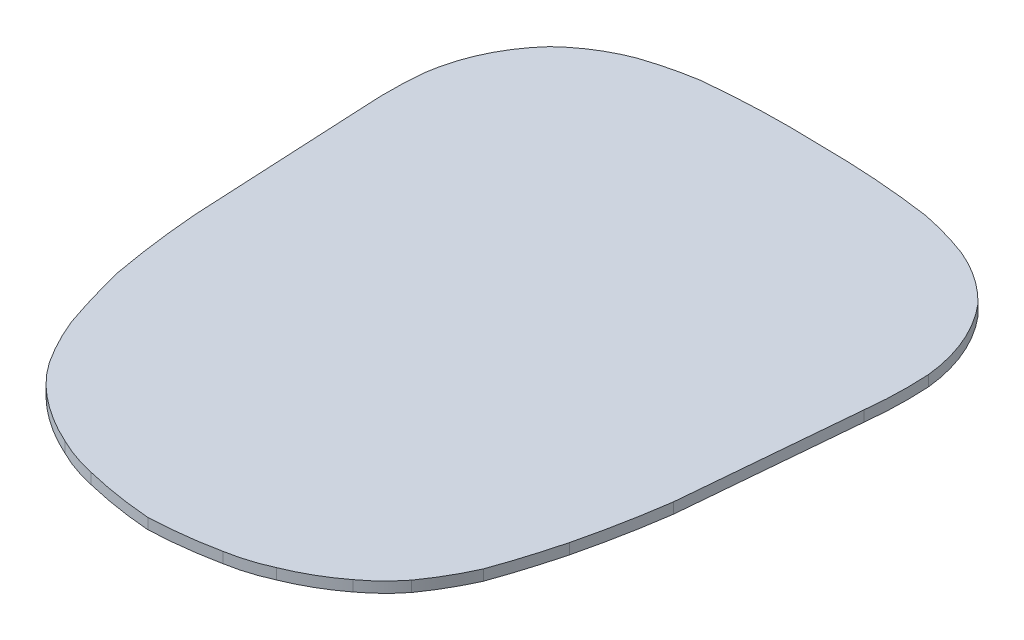
ISO-10303-21;
HEADER;
FILE_DESCRIPTION(('STEP AP214'),'2;1');
FILE_NAME('part.step','',(''),(''),'','','');
FILE_SCHEMA(('AUTOMOTIVE_DESIGN { 1 0 10303 214 1 1 1 1 }'));
ENDSEC;
DATA;
#1=APPLICATION_CONTEXT('core data for automotive mechanical design processes');
#2=APPLICATION_PROTOCOL_DEFINITION('international standard','automotive_design',2000,#1);
#3=PRODUCT_CONTEXT('',#1,'mechanical');
#4=PRODUCT('Part','Part','',(#3));
#5=PRODUCT_RELATED_PRODUCT_CATEGORY('part','',(#4));
#6=PRODUCT_DEFINITION_FORMATION('','',#4);
#7=PRODUCT_DEFINITION_CONTEXT('part definition',#1,'design');
#8=PRODUCT_DEFINITION('design','',#6,#7);
#9=PRODUCT_DEFINITION_SHAPE('','',#8);
#10=(LENGTH_UNIT() NAMED_UNIT(*) SI_UNIT(.MILLI.,.METRE.));
#11=(NAMED_UNIT(*) PLANE_ANGLE_UNIT() SI_UNIT($,.RADIAN.));
#12=(NAMED_UNIT(*) SI_UNIT($,.STERADIAN.) SOLID_ANGLE_UNIT());
#13=UNCERTAINTY_MEASURE_WITH_UNIT(LENGTH_MEASURE(1.E-05),#10,'distance_accuracy_value','');
#14=(GEOMETRIC_REPRESENTATION_CONTEXT(3) GLOBAL_UNCERTAINTY_ASSIGNED_CONTEXT((#13)) GLOBAL_UNIT_ASSIGNED_CONTEXT((#10,
#11,#12)) REPRESENTATION_CONTEXT('',''));
#15=CARTESIAN_POINT('',(0.,0.,0.));
#16=DIRECTION('',(0.,0.,1.));
#17=DIRECTION('',(1.,0.,0.));
#18=AXIS2_PLACEMENT_3D('',#15,#16,#17);
#19=CARTESIAN_POINT('',(4.71009628830566,8.17060732929225,26.5172961946225));
#20=DIRECTION('',(0.,1.,0.));
#21=DIRECTION('',(1.,0.,0.));
#22=AXIS2_PLACEMENT_3D('',#19,#20,#21);
#23=PLANE('',#22);
#24=CARTESIAN_POINT('',(-2.27662830007277,8.17060732929219,38.4722908655234));
#25=DIRECTION('',(0.,-1.,0.));
#26=DIRECTION('',(-1.,0.,0.));
#27=AXIS2_PLACEMENT_3D('',#24,#25,#26);
#28=CIRCLE('',#27,12.60940452968);
#29=CARTESIAN_POINT('',(9.22351885768009,8.17060732929263,43.6437218031986));
#30=VERTEX_POINT('',#29);
#31=CARTESIAN_POINT('',(8.0018089067517,8.17060732929262,45.7764548271607));
#32=VERTEX_POINT('',#31);
#33=EDGE_CURVE('E342',#30,#32,#28,.T.);
#34=ORIENTED_EDGE('',*,*,#33,.F.);
#35=CARTESIAN_POINT('',(-23.6697185475928,8.17060732929142,31.8539569853535));
#36=DIRECTION('',(0.,-1.,0.));
#37=DIRECTION('',(-1.,0.,0.));
#38=AXIS2_PLACEMENT_3D('',#35,#36,#37);
#39=CIRCLE('',#38,34.94228987144);
#40=CARTESIAN_POINT('',(10.1680744257548,8.17060732929263,40.5698842540157));
#41=VERTEX_POINT('',#40);
#42=EDGE_CURVE('E338',#41,#30,#39,.T.);
#43=ORIENTED_EDGE('',*,*,#42,.F.);
#44=CARTESIAN_POINT('',(-29.9774053404909,8.1706073292912,30.7359674961748));
#45=DIRECTION('',(0.,-1.,0.));
#46=DIRECTION('',(-1.,0.,0.));
#47=AXIS2_PLACEMENT_3D('',#44,#45,#46);
#48=CIRCLE('',#47,41.33237791928);
#49=CARTESIAN_POINT('',(10.952153070885,8.17060732929257,36.4924171582454));
#50=VERTEX_POINT('',#49);
#51=EDGE_CURVE('E334',#50,#41,#48,.T.);
#52=ORIENTED_EDGE('',*,*,#51,.F.);
#53=DIRECTION('',(-0.0886995040357044,0.,0.996058431008854));
#54=VECTOR('',#53,1.);
#55=CARTESIAN_POINT('',(11.6806465076375,8.17060732929258,28.3117397407053));
#56=LINE('',#55,#54);
#57=CARTESIAN_POINT('',(11.6806465076375,8.17060732929253,28.3117397407053));
#58=VERTEX_POINT('',#57);
#59=EDGE_CURVE('E221',#50,#58,#56,.F.);
#60=ORIENTED_EDGE('',*,*,#59,.T.);
#61=CARTESIAN_POINT('',(-5.02148164229073,8.17060732929194,26.393099302876));
#62=DIRECTION('',(0.,-1.,0.));
#63=DIRECTION('',(-1.,0.,0.));
#64=AXIS2_PLACEMENT_3D('',#61,#62,#63);
#65=CIRCLE('',#64,16.81196793556);
#66=CARTESIAN_POINT('',(11.7593440485896,8.17060732929246,25.370282115599));
#67=VERTEX_POINT('',#66);
#68=EDGE_CURVE('E331',#67,#58,#65,.T.);
#69=ORIENTED_EDGE('',*,*,#68,.F.);
#70=CARTESIAN_POINT('',(4.42207857906214,8.17060732929224,26.1060065080088));
#71=DIRECTION('',(0.,-1.,0.));
#72=DIRECTION('',(-1.,0.,0.));
#73=AXIS2_PLACEMENT_3D('',#70,#71,#72);
#74=CIRCLE('',#73,7.3740595978);
#75=CARTESIAN_POINT('',(10.0538039694727,8.17060732929235,21.3457098703073));
#76=VERTEX_POINT('',#75);
#77=EDGE_CURVE('E326',#76,#67,#74,.T.);
#78=ORIENTED_EDGE('',*,*,#77,.F.);
#79=CARTESIAN_POINT('',(4.71009628830566,8.17060732929225,26.5172961946225));
#80=DIRECTION('',(0.,-1.,0.));
#81=DIRECTION('',(-1.,0.,0.));
#82=AXIS2_PLACEMENT_3D('',#79,#80,#81);
#83=CIRCLE('',#82,7.43643173111999);
#84=CARTESIAN_POINT('',(7.59877825453688,8.17060732929224,19.6648489391102));
#85=VERTEX_POINT('',#84);
#86=EDGE_CURVE('E202',#85,#76,#83,.T.);
#87=ORIENTED_EDGE('',*,*,#86,.F.);
#88=CARTESIAN_POINT('',(2.32340041465539,8.17060732929227,33.6186466915631));
#89=DIRECTION('',(0.,-1.,0.));
#90=DIRECTION('',(-1.,0.,0.));
#91=AXIS2_PLACEMENT_3D('',#88,#89,#90);
#92=CIRCLE('',#91,14.91771038296);
#93=CARTESIAN_POINT('',(5.25502065738684,8.17060732929216,18.9918327588476));
#94=VERTEX_POINT('',#93);
#95=EDGE_CURVE('E20',#94,#85,#92,.T.);
#96=ORIENTED_EDGE('',*,*,#95,.F.);
#97=CARTESIAN_POINT('',(-0.135712780641824,8.17060732929251,56.7959011448421));
#98=DIRECTION('',(0.,-1.,0.));
#99=DIRECTION('',(-1.,0.,0.));
#100=AXIS2_PLACEMENT_3D('',#97,#98,#99);
#101=CIRCLE('',#100,38.186484435371);
#102=CARTESIAN_POINT('',(-0.11509847713785,8.17060732929198,18.6094222736066));
#103=VERTEX_POINT('',#102);
#104=EDGE_CURVE('E187',#103,#94,#101,.T.);
#105=ORIENTED_EDGE('',*,*,#104,.F.);
#106=CARTESIAN_POINT('',(-1.57240860866994,8.17060732929247,56.7680888848849));
#107=DIRECTION('',(0.,-1.,0.));
#108=DIRECTION('',(-1.,0.,0.));
#109=AXIS2_PLACEMENT_3D('',#106,#107,#108);
#110=CIRCLE('',#109,38.18648439396);
#111=CARTESIAN_POINT('',(-5.4959944251525,8.17060732929181,18.7837096651208));
#112=VERTEX_POINT('',#111);
#113=EDGE_CURVE('E211',#112,#103,#110,.T.);
#114=ORIENTED_EDGE('',*,*,#113,.F.);
#115=CARTESIAN_POINT('',(-3.13266364538485,8.17060732929209,33.5130256945661));
#116=DIRECTION('',(0.,-1.,0.));
#117=DIRECTION('',(-1.,0.,0.));
#118=AXIS2_PLACEMENT_3D('',#115,#116,#117);
#119=CIRCLE('',#118,14.91771038296);
#120=CARTESIAN_POINT('',(-7.86404338634437,8.17060732929175,19.3655125273444));
#121=VERTEX_POINT('',#120);
#122=EDGE_CURVE('E400',#121,#112,#119,.T.);
#123=ORIENTED_EDGE('',*,*,#122,.F.);
#124=CARTESIAN_POINT('',(-5.24273193998366,8.17060732929193,26.3246247690593));
#125=DIRECTION('',(0.,-1.,0.));
#126=DIRECTION('',(-1.,0.,0.));
#127=AXIS2_PLACEMENT_3D('',#124,#125,#126);
#128=CIRCLE('',#127,7.43643173112);
#129=CARTESIAN_POINT('',(-10.3822831278824,8.17060732929169,20.9500986989228));
#130=VERTEX_POINT('',#129);
#131=EDGE_CURVE('E396',#130,#121,#128,.T.);
#132=ORIENTED_EDGE('',*,*,#131,.F.);
#133=CARTESIAN_POINT('',(-4.93901211459919,8.17060732929193,25.9247902097461));
#134=DIRECTION('',(0.,-1.,0.));
#135=DIRECTION('',(-1.,0.,0.));
#136=AXIS2_PLACEMENT_3D('',#133,#134,#135);
#137=CIRCLE('',#136,7.3740595978);
#138=CARTESIAN_POINT('',(-12.2423060527563,8.17060732929169,24.9056471359907));
#139=VERTEX_POINT('',#138);
#140=EDGE_CURVE('E392',#139,#130,#137,.T.);
#141=ORIENTED_EDGE('',*,*,#140,.F.);
#142=CARTESIAN_POINT('',(4.48636162568603,8.17060732929224,26.5771565049552));
#143=DIRECTION('',(0.,-1.,0.));
#144=DIRECTION('',(-1.,0.,0.));
#145=AXIS2_PLACEMENT_3D('',#142,#143,#144);
#146=CIRCLE('',#145,16.81196793556);
#147=CARTESIAN_POINT('',(-12.2775089900257,8.17060732929172,27.8479467496356));
#148=VERTEX_POINT('',#147);
#149=EDGE_CURVE('E388',#148,#139,#146,.T.);
#150=ORIENTED_EDGE('',*,*,#149,.F.);
#151=DIRECTION('',(-0.0500831809567766,0.,-0.998745050042928));
#152=VECTOR('',#151,1.);
#153=CARTESIAN_POINT('',(-11.8661733347101,8.17060732929172,36.0506895028802));
#154=LINE('',#153,#152);
#155=CARTESIAN_POINT('',(-11.86617333471,8.17060732929178,36.0506895028806));
#156=VERTEX_POINT('',#155);
#157=EDGE_CURVE('E227',#148,#156,#154,.F.);
#158=ORIENTED_EDGE('',*,*,#157,.T.);
#159=CARTESIAN_POINT('',(29.3351155793446,8.17060732929312,32.7614257124886));
#160=DIRECTION('',(0.,-1.,0.));
#161=DIRECTION('',(-1.,0.,0.));
#162=AXIS2_PLACEMENT_3D('',#159,#160,#161);
#163=CIRCLE('',#162,41.33237791928);
#164=CARTESIAN_POINT('',(-11.3308378537234,8.17060732929194,40.1536984240254));
#165=VERTEX_POINT('',#164);
#166=EDGE_CURVE('E386',#165,#156,#163,.T.);
#167=ORIENTED_EDGE('',*,*,#166,.F.);
#168=CARTESIAN_POINT('',(22.6114523086669,8.1706073292929,31.8540261418301));
#169=DIRECTION('',(0.,-1.,0.));
#170=DIRECTION('',(-1.,0.,0.));
#171=AXIS2_PLACEMENT_3D('',#168,#169,#170);
#172=CIRCLE('',#171,34.94228987144);
#173=CARTESIAN_POINT('',(-10.4156070143637,8.17060732929201,43.2635385736895));
#174=VERTEX_POINT('',#173);
#175=EDGE_CURVE('E382',#174,#165,#172,.T.);
#176=ORIENTED_EDGE('',*,*,#175,.F.);
#177=CARTESIAN_POINT('',(1.27607088396138,8.17060732929231,38.5410656500053));
#178=DIRECTION('',(0.,-1.,0.));
#179=DIRECTION('',(-1.,0.,0.));
#180=AXIS2_PLACEMENT_3D('',#177,#178,#179);
#181=CIRCLE('',#180,12.60940452968);
#182=CARTESIAN_POINT('',(-9.27735431255513,8.17060732929206,45.4419568398912));
#183=VERTEX_POINT('',#182);
#184=EDGE_CURVE('E378',#183,#174,#181,.T.);
#185=ORIENTED_EDGE('',*,*,#184,.F.);
#186=CARTESIAN_POINT('',(-3.45763258069564,8.17060732929219,41.376110818803));
#187=DIRECTION('',(0.,-1.,0.));
#188=DIRECTION('',(-1.,0.,0.));
#189=AXIS2_PLACEMENT_3D('',#186,#187,#188);
#190=CIRCLE('',#189,7.09931439672);
#191=CARTESIAN_POINT('',(-7.97915028682798,8.17060732929213,46.8493313092097));
#192=VERTEX_POINT('',#191);
#193=EDGE_CURVE('E374',#192,#183,#190,.T.);
#194=ORIENTED_EDGE('',*,*,#193,.F.);
#195=CARTESIAN_POINT('',(-1.74390750050744,8.17060732929222,39.3302094350336));
#196=DIRECTION('',(0.,-1.,0.));
#197=DIRECTION('',(-1.,0.,0.));
#198=AXIS2_PLACEMENT_3D('',#195,#196,#197);
#199=CIRCLE('',#198,9.76808304444);
#200=CARTESIAN_POINT('',(-5.75361833776054,8.17060732929222,48.2373787589373));
#201=VERTEX_POINT('',#200);
#202=EDGE_CURVE('E370',#201,#192,#199,.T.);
#203=ORIENTED_EDGE('',*,*,#202,.F.);
#204=CARTESIAN_POINT('',(-2.25185647870526,8.17060732929223,41.3098252240713));
#205=DIRECTION('',(0.,-1.,0.));
#206=DIRECTION('',(-1.,0.,0.));
#207=AXIS2_PLACEMENT_3D('',#204,#205,#206);
#208=CIRCLE('',#207,7.76230211316);
#209=CARTESIAN_POINT('',(-3.87229574569533,8.17060732929228,48.9011038171652));
#210=VERTEX_POINT('',#209);
#211=EDGE_CURVE('E366',#210,#201,#208,.T.);
#212=ORIENTED_EDGE('',*,*,#211,.F.);
#213=CARTESIAN_POINT('',(0.780834496719686,8.17060732929217,29.8233057086877));
#214=DIRECTION('',(0.,-1.,0.));
#215=DIRECTION('',(-1.,0.,0.));
#216=AXIS2_PLACEMENT_3D('',#213,#214,#215);
#217=CIRCLE('',#216,19.63705684976);
#218=CARTESIAN_POINT('',(-0.711226246908824,8.1706073292924,49.4035957080219));
#219=VERTEX_POINT('',#218);
#220=EDGE_CURVE('E362',#219,#210,#217,.T.);
#221=ORIENTED_EDGE('',*,*,#220,.F.);
#222=CARTESIAN_POINT('',(-1.50562705310564,8.1706073292921,29.7823019466603));
#223=DIRECTION('',(0.,-1.,0.));
#224=DIRECTION('',(-1.,0.,0.));
#225=AXIS2_PLACEMENT_3D('',#222,#223,#224);
#226=CIRCLE('',#225,19.6373684976);
#227=CARTESIAN_POINT('',(2.42169589731131,8.17060732929249,49.0229458016269));
#228=VERTEX_POINT('',#227);
#229=EDGE_CURVE('E358',#228,#219,#226,.T.);
#230=ORIENTED_EDGE('',*,*,#229,.F.);
#231=CARTESIAN_POINT('',(1.09627151620212,8.17060732929234,41.3746398254038));
#232=DIRECTION('',(0.,-1.,0.));
#233=DIRECTION('',(-1.,0.,0.));
#234=AXIS2_PLACEMENT_3D('',#231,#232,#233);
#235=CIRCLE('',#234,7.76230211316);
#236=CARTESIAN_POINT('',(4.32729672971708,8.17060732929254,48.4325297484331));
#237=VERTEX_POINT('',#236);
#238=EDGE_CURVE('E354',#237,#228,#235,.T.);
#239=ORIENTED_EDGE('',*,*,#238,.F.);
#240=CARTESIAN_POINT('',(0.665319016808416,8.1706073292923,39.3768483498173));
#241=DIRECTION('',(0.,-1.,0.));
#242=DIRECTION('',(-1.,0.,0.));
#243=AXIS2_PLACEMENT_3D('',#240,#241,#242);
#244=CIRCLE('',#243,9.76808304444);
#245=CARTESIAN_POINT('',(6.60488205735884,8.1706073292926,47.1316557136661));
#246=VERTEX_POINT('',#245);
#247=EDGE_CURVE('E350',#246,#237,#244,.T.);
#248=ORIENTED_EDGE('',*,*,#247,.F.);
#249=CARTESIAN_POINT('',(2.40671094314165,8.17060732929238,41.4066557836025));
#250=DIRECTION('',(0.,-1.,0.));
#251=DIRECTION('',(-1.,0.,0.));
#252=AXIS2_PLACEMENT_3D('',#249,#250,#251);
#253=CIRCLE('',#252,7.09931439672);
#254=EDGE_CURVE('E346',#32,#246,#253,.T.);
#255=ORIENTED_EDGE('',*,*,#254,.F.);
#256=EDGE_LOOP('',(#34,#43,#52,#60,#69,#78,#87,#96,#105,#114,#123,#132,#141,#150,#158,#167,#176,
#185,#194,#203,#212,#221,#230,#239,#248,#255));
#257=FACE_BOUND('',#256,.T.);
#258=ADVANCED_FACE('F17',(#257),#23,.T.);
#259=CARTESIAN_POINT('',(2.32340041465539,8.05060732929227,33.6186466915631));
#260=DIRECTION('',(0.,-1.,0.));
#261=DIRECTION('',(-1.,0.,0.));
#262=AXIS2_PLACEMENT_3D('',#259,#260,#261);
#263=CYLINDRICAL_SURFACE('',#262,14.91771038296);
#264=DIRECTION('',(0.,-1.,0.));
#265=VECTOR('',#264,1.);
#266=CARTESIAN_POINT('',(7.59877825453691,8.05060732929224,19.6648489391103));
#267=LINE('',#266,#265);
#268=CARTESIAN_POINT('',(7.5987782545369,7.66960732929226,19.6648489391102));
#269=VERTEX_POINT('',#268);
#270=EDGE_CURVE('E325',#269,#85,#267,.F.);
#271=ORIENTED_EDGE('',*,*,#270,.F.);
#272=CARTESIAN_POINT('',(2.3234004146554,7.66960732929227,33.6186466915632));
#273=DIRECTION('',(0.,-1.,0.));
#274=DIRECTION('',(-1.,0.,0.));
#275=AXIS2_PLACEMENT_3D('',#272,#273,#274);
#276=CIRCLE('',#275,14.91771038296);
#277=CARTESIAN_POINT('',(5.25502065738685,7.66960732929216,18.9918327588476));
#278=VERTEX_POINT('',#277);
#279=EDGE_CURVE('E209',#269,#278,#276,.F.);
#280=ORIENTED_EDGE('',*,*,#279,.T.);
#281=DIRECTION('',(0.,-1.,0.));
#282=VECTOR('',#281,1.);
#283=CARTESIAN_POINT('',(5.25502065738685,8.05060732929216,18.9918327588476));
#284=LINE('',#283,#282);
#285=EDGE_CURVE('E192',#94,#278,#284,.T.);
#286=ORIENTED_EDGE('',*,*,#285,.F.);
#287=ORIENTED_EDGE('',*,*,#95,.T.);
#288=EDGE_LOOP('',(#271,#280,#286,#287));
#289=FACE_BOUND('',#288,.T.);
#290=ADVANCED_FACE('F208',(#289),#263,.T.);
#291=CARTESIAN_POINT('',(-0.13571278064182,8.05060732929252,56.7959011448421));
#292=DIRECTION('',(0.,-1.,0.));
#293=DIRECTION('',(-1.,0.,0.));
#294=AXIS2_PLACEMENT_3D('',#291,#292,#293);
#295=CYLINDRICAL_SURFACE('',#294,38.186484435371);
#296=ORIENTED_EDGE('',*,*,#285,.T.);
#297=CARTESIAN_POINT('',(-0.135712780641808,7.66960732929252,56.7959011448422));
#298=DIRECTION('',(0.,-1.,0.));
#299=DIRECTION('',(-1.,0.,0.));
#300=AXIS2_PLACEMENT_3D('',#297,#298,#299);
#301=CIRCLE('',#300,38.186484435371);
#302=CARTESIAN_POINT('',(-0.115098477137834,7.66960732929198,18.6094222736066));
#303=VERTEX_POINT('',#302);
#304=EDGE_CURVE('E318',#278,#303,#301,.F.);
#305=ORIENTED_EDGE('',*,*,#304,.T.);
#306=DIRECTION('',(0.,-1.,0.));
#307=VECTOR('',#306,1.);
#308=CARTESIAN_POINT('',(-0.115098477137861,8.05060732929198,18.6094222736066));
#309=LINE('',#308,#307);
#310=EDGE_CURVE('E194',#103,#303,#309,.T.);
#311=ORIENTED_EDGE('',*,*,#310,.F.);
#312=ORIENTED_EDGE('',*,*,#104,.T.);
#313=EDGE_LOOP('',(#296,#305,#311,#312));
#314=FACE_BOUND('',#313,.T.);
#315=ADVANCED_FACE('F189',(#314),#295,.T.);
#316=CARTESIAN_POINT('',(-1.57240860866994,8.05060732929247,56.7680888848849));
#317=DIRECTION('',(0.,-1.,0.));
#318=DIRECTION('',(-1.,0.,0.));
#319=AXIS2_PLACEMENT_3D('',#316,#317,#318);
#320=CYLINDRICAL_SURFACE('',#319,38.18648439396);
#321=ORIENTED_EDGE('',*,*,#310,.T.);
#322=CARTESIAN_POINT('',(-1.57240860866992,7.66960732929248,56.7680888848849));
#323=DIRECTION('',(0.,-1.,0.));
#324=DIRECTION('',(-1.,0.,0.));
#325=AXIS2_PLACEMENT_3D('',#322,#323,#324);
#326=CIRCLE('',#325,38.18648439396);
#327=CARTESIAN_POINT('',(-5.49599442515248,7.66960732929181,18.7837096651208));
#328=VERTEX_POINT('',#327);
#329=EDGE_CURVE('E314',#303,#328,#326,.F.);
#330=ORIENTED_EDGE('',*,*,#329,.T.);
#331=DIRECTION('',(0.,-1.,0.));
#332=VECTOR('',#331,1.);
#333=CARTESIAN_POINT('',(-5.49599442515248,8.05060732929181,18.7837096651208));
#334=LINE('',#333,#332);
#335=EDGE_CURVE('E399',#112,#328,#334,.T.);
#336=ORIENTED_EDGE('',*,*,#335,.F.);
#337=ORIENTED_EDGE('',*,*,#113,.T.);
#338=EDGE_LOOP('',(#321,#330,#336,#337));
#339=FACE_BOUND('',#338,.T.);
#340=ADVANCED_FACE('F410',(#339),#320,.T.);
#341=CARTESIAN_POINT('',(-3.13266364538485,8.0506073292921,33.5130256945661));
#342=DIRECTION('',(0.,-1.,0.));
#343=DIRECTION('',(-1.,0.,0.));
#344=AXIS2_PLACEMENT_3D('',#341,#342,#343);
#345=CYLINDRICAL_SURFACE('',#344,14.91771038296);
#346=ORIENTED_EDGE('',*,*,#335,.T.);
#347=CARTESIAN_POINT('',(-3.13266364538484,7.6696073292921,33.5130256945661));
#348=DIRECTION('',(0.,-1.,0.));
#349=DIRECTION('',(-1.,0.,0.));
#350=AXIS2_PLACEMENT_3D('',#347,#348,#349);
#351=CIRCLE('',#350,14.91771038296);
#352=CARTESIAN_POINT('',(-7.86404338634436,7.66960732929176,19.3655125273444));
#353=VERTEX_POINT('',#352);
#354=EDGE_CURVE('E310',#328,#353,#351,.F.);
#355=ORIENTED_EDGE('',*,*,#354,.T.);
#356=DIRECTION('',(0.,-1.,0.));
#357=VECTOR('',#356,1.);
#358=CARTESIAN_POINT('',(-7.86404338634434,8.05060732929175,19.3655125273444));
#359=LINE('',#358,#357);
#360=EDGE_CURVE('E395',#121,#353,#359,.T.);
#361=ORIENTED_EDGE('',*,*,#360,.F.);
#362=ORIENTED_EDGE('',*,*,#122,.T.);
#363=EDGE_LOOP('',(#346,#355,#361,#362));
#364=FACE_BOUND('',#363,.T.);
#365=ADVANCED_FACE('F418',(#364),#345,.T.);
#366=CARTESIAN_POINT('',(-5.24273193998366,8.05060732929193,26.3246247690593));
#367=DIRECTION('',(0.,-1.,0.));
#368=DIRECTION('',(-1.,0.,0.));
#369=AXIS2_PLACEMENT_3D('',#366,#367,#368);
#370=CYLINDRICAL_SURFACE('',#369,7.43643173112);
#371=ORIENTED_EDGE('',*,*,#360,.T.);
#372=CARTESIAN_POINT('',(-5.24273193998365,7.66960732929194,26.3246247690593));
#373=DIRECTION('',(0.,-1.,0.));
#374=DIRECTION('',(-1.,0.,0.));
#375=AXIS2_PLACEMENT_3D('',#372,#373,#374);
#376=CIRCLE('',#375,7.43643173112);
#377=CARTESIAN_POINT('',(-10.3822831278824,7.66960732929169,20.9500986989228));
#378=VERTEX_POINT('',#377);
#379=EDGE_CURVE('E306',#353,#378,#376,.F.);
#380=ORIENTED_EDGE('',*,*,#379,.T.);
#381=DIRECTION('',(0.,-1.,0.));
#382=VECTOR('',#381,1.);
#383=CARTESIAN_POINT('',(-10.3822831278824,8.05060732929169,20.9500986989228));
#384=LINE('',#383,#382);
#385=EDGE_CURVE('E391',#130,#378,#384,.T.);
#386=ORIENTED_EDGE('',*,*,#385,.F.);
#387=ORIENTED_EDGE('',*,*,#131,.T.);
#388=EDGE_LOOP('',(#371,#380,#386,#387));
#389=FACE_BOUND('',#388,.T.);
#390=ADVANCED_FACE('F559',(#389),#370,.T.);
#391=CARTESIAN_POINT('',(-4.93901211459919,8.05060732929193,25.9247902097461));
#392=DIRECTION('',(0.,-1.,0.));
#393=DIRECTION('',(-1.,0.,0.));
#394=AXIS2_PLACEMENT_3D('',#391,#392,#393);
#395=CYLINDRICAL_SURFACE('',#394,7.3740595978);
#396=ORIENTED_EDGE('',*,*,#385,.T.);
#397=CARTESIAN_POINT('',(-4.93901211459917,7.66960732929193,25.9247902097461));
#398=DIRECTION('',(0.,-1.,0.));
#399=DIRECTION('',(-1.,0.,0.));
#400=AXIS2_PLACEMENT_3D('',#397,#398,#399);
#401=CIRCLE('',#400,7.3740595978);
#402=CARTESIAN_POINT('',(-12.2423060527563,7.66960732929169,24.9056471359907));
#403=VERTEX_POINT('',#402);
#404=EDGE_CURVE('E302',#378,#403,#401,.F.);
#405=ORIENTED_EDGE('',*,*,#404,.T.);
#406=DIRECTION('',(0.,-1.,0.));
#407=VECTOR('',#406,1.);
#408=CARTESIAN_POINT('',(-12.2423060527563,8.05060732929169,24.9056471359907));
#409=LINE('',#408,#407);
#410=EDGE_CURVE('E231',#139,#403,#409,.T.);
#411=ORIENTED_EDGE('',*,*,#410,.F.);
#412=ORIENTED_EDGE('',*,*,#140,.T.);
#413=EDGE_LOOP('',(#396,#405,#411,#412));
#414=FACE_BOUND('',#413,.T.);
#415=ADVANCED_FACE('F556',(#414),#395,.T.);
#416=CARTESIAN_POINT('',(4.48636162568604,8.05060732929224,26.5771565049552));
#417=DIRECTION('',(0.,-1.,0.));
#418=DIRECTION('',(-1.,0.,0.));
#419=AXIS2_PLACEMENT_3D('',#416,#417,#418);
#420=CYLINDRICAL_SURFACE('',#419,16.81196793556);
#421=ORIENTED_EDGE('',*,*,#410,.T.);
#422=CARTESIAN_POINT('',(4.48636162568605,7.66960732929224,26.5771565049552));
#423=DIRECTION('',(0.,-1.,0.));
#424=DIRECTION('',(-1.,0.,0.));
#425=AXIS2_PLACEMENT_3D('',#422,#423,#424);
#426=CIRCLE('',#425,16.81196793556);
#427=CARTESIAN_POINT('',(-12.2775089900257,7.66960732929173,27.8479467496356));
#428=VERTEX_POINT('',#427);
#429=EDGE_CURVE('E298',#403,#428,#426,.F.);
#430=ORIENTED_EDGE('',*,*,#429,.T.);
#431=DIRECTION('',(0.,1.,0.));
#432=VECTOR('',#431,1.);
#433=CARTESIAN_POINT('',(-12.2775089900257,8.05060732929185,27.8479467496356));
#434=LINE('',#433,#432);
#435=EDGE_CURVE('E230',#428,#148,#434,.T.);
#436=ORIENTED_EDGE('',*,*,#435,.T.);
#437=ORIENTED_EDGE('',*,*,#149,.T.);
#438=EDGE_LOOP('',(#421,#430,#436,#437));
#439=FACE_BOUND('',#438,.T.);
#440=ADVANCED_FACE('F552',(#439),#420,.T.);
#441=CARTESIAN_POINT('',(-11.8661733347101,8.05060732929185,36.0506895028802));
#442=DIRECTION('',(0.998745050042928,0.,-0.0500831809567766));
#443=DIRECTION('',(-0.0500831809567766,0.,-0.998745050042928));
#444=AXIS2_PLACEMENT_3D('',#441,#442,#443);
#445=PLANE('',#444);
#446=DIRECTION('',(0.0500831809567767,0.,0.998745050042928));
#447=VECTOR('',#446,1.);
#448=CARTESIAN_POINT('',(-12.2775089900257,7.66960732929172,27.8479467496356));
#449=LINE('',#448,#447);
#450=CARTESIAN_POINT('',(-11.86617333471,7.66960732929185,36.0506895028806));
#451=VERTEX_POINT('',#450);
#452=EDGE_CURVE('E297',#428,#451,#449,.T.);
#453=ORIENTED_EDGE('',*,*,#452,.T.);
#454=DIRECTION('',(0.,-1.,0.));
#455=VECTOR('',#454,1.);
#456=CARTESIAN_POINT('',(-11.86617333471,8.05060732929185,36.0506895028805));
#457=LINE('',#456,#455);
#458=EDGE_CURVE('E385',#156,#451,#457,.T.);
#459=ORIENTED_EDGE('',*,*,#458,.F.);
#460=ORIENTED_EDGE('',*,*,#157,.F.);
#461=ORIENTED_EDGE('',*,*,#435,.F.);
#462=EDGE_LOOP('',(#453,#459,#460,#461));
#463=FACE_BOUND('',#462,.T.);
#464=ADVANCED_FACE('F549',(#463),#445,.F.);
#465=CARTESIAN_POINT('',(29.3351155793446,8.05060732929312,32.7614257124887));
#466=DIRECTION('',(0.,-1.,0.));
#467=DIRECTION('',(-1.,0.,0.));
#468=AXIS2_PLACEMENT_3D('',#465,#466,#467);
#469=CYLINDRICAL_SURFACE('',#468,41.33237791928);
#470=ORIENTED_EDGE('',*,*,#458,.T.);
#471=CARTESIAN_POINT('',(29.3351155793447,7.66960732929312,32.7614257124887));
#472=DIRECTION('',(0.,-1.,0.));
#473=DIRECTION('',(-1.,0.,0.));
#474=AXIS2_PLACEMENT_3D('',#471,#472,#473);
#475=CIRCLE('',#474,41.33237791928);
#476=CARTESIAN_POINT('',(-11.3308378537234,7.66960732929192,40.1536984240254));
#477=VERTEX_POINT('',#476);
#478=EDGE_CURVE('E293',#451,#477,#475,.F.);
#479=ORIENTED_EDGE('',*,*,#478,.T.);
#480=DIRECTION('',(0.,-1.,0.));
#481=VECTOR('',#480,1.);
#482=CARTESIAN_POINT('',(-11.3308378537233,8.05060732929194,40.1536984240255));
#483=LINE('',#482,#481);
#484=EDGE_CURVE('E381',#165,#477,#483,.T.);
#485=ORIENTED_EDGE('',*,*,#484,.F.);
#486=ORIENTED_EDGE('',*,*,#166,.T.);
#487=EDGE_LOOP('',(#470,#479,#485,#486));
#488=FACE_BOUND('',#487,.T.);
#489=ADVANCED_FACE('F544',(#488),#469,.T.);
#490=CARTESIAN_POINT('',(22.6114523086669,8.0506073292929,31.8540261418301));
#491=DIRECTION('',(0.,-1.,0.));
#492=DIRECTION('',(-1.,0.,0.));
#493=AXIS2_PLACEMENT_3D('',#490,#491,#492);
#494=CYLINDRICAL_SURFACE('',#493,34.94228987144);
#495=ORIENTED_EDGE('',*,*,#484,.T.);
#496=CARTESIAN_POINT('',(22.6114523086669,7.66960732929289,31.8540261418301));
#497=DIRECTION('',(0.,-1.,0.));
#498=DIRECTION('',(-1.,0.,0.));
#499=AXIS2_PLACEMENT_3D('',#496,#497,#498);
#500=CIRCLE('',#499,34.94228987144);
#501=CARTESIAN_POINT('',(-10.4156070143637,7.66960732929199,43.2635385736895));
#502=VERTEX_POINT('',#501);
#503=EDGE_CURVE('E289',#477,#502,#500,.F.);
#504=ORIENTED_EDGE('',*,*,#503,.T.);
#505=DIRECTION('',(0.,-1.,0.));
#506=VECTOR('',#505,1.);
#507=CARTESIAN_POINT('',(-10.4156070143637,8.05060732929201,43.2635385736894));
#508=LINE('',#507,#506);
#509=EDGE_CURVE('E377',#174,#502,#508,.T.);
#510=ORIENTED_EDGE('',*,*,#509,.F.);
#511=ORIENTED_EDGE('',*,*,#175,.T.);
#512=EDGE_LOOP('',(#495,#504,#510,#511));
#513=FACE_BOUND('',#512,.T.);
#514=ADVANCED_FACE('F540',(#513),#494,.T.);
#515=CARTESIAN_POINT('',(1.27607088396139,8.05060732929231,38.5410656500053));
#516=DIRECTION('',(0.,-1.,0.));
#517=DIRECTION('',(-1.,0.,0.));
#518=AXIS2_PLACEMENT_3D('',#515,#516,#517);
#519=CYLINDRICAL_SURFACE('',#518,12.60940452968);
#520=ORIENTED_EDGE('',*,*,#509,.T.);
#521=CARTESIAN_POINT('',(1.2760708839614,7.6696073292923,38.5410656500053));
#522=DIRECTION('',(0.,-1.,0.));
#523=DIRECTION('',(-1.,0.,0.));
#524=AXIS2_PLACEMENT_3D('',#521,#522,#523);
#525=CIRCLE('',#524,12.60940452968);
#526=CARTESIAN_POINT('',(-9.27735431255511,7.66960732929208,45.4419568398912));
#527=VERTEX_POINT('',#526);
#528=EDGE_CURVE('E285',#502,#527,#525,.F.);
#529=ORIENTED_EDGE('',*,*,#528,.T.);
#530=DIRECTION('',(0.,-1.,0.));
#531=VECTOR('',#530,1.);
#532=CARTESIAN_POINT('',(-9.27735431255513,8.05060732929206,45.4419568398912));
#533=LINE('',#532,#531);
#534=EDGE_CURVE('E373',#183,#527,#533,.T.);
#535=ORIENTED_EDGE('',*,*,#534,.F.);
#536=ORIENTED_EDGE('',*,*,#184,.T.);
#537=EDGE_LOOP('',(#520,#529,#535,#536));
#538=FACE_BOUND('',#537,.T.);
#539=ADVANCED_FACE('F534',(#538),#519,.T.);
#540=CARTESIAN_POINT('',(-3.45763258069563,8.05060732929219,41.376110818803));
#541=DIRECTION('',(0.,-1.,0.));
#542=DIRECTION('',(-1.,0.,0.));
#543=AXIS2_PLACEMENT_3D('',#540,#541,#542);
#544=CYLINDRICAL_SURFACE('',#543,7.09931439672);
#545=ORIENTED_EDGE('',*,*,#534,.T.);
#546=CARTESIAN_POINT('',(-3.45763258069562,7.6696073292922,41.376110818803));
#547=DIRECTION('',(0.,-1.,0.));
#548=DIRECTION('',(-1.,0.,0.));
#549=AXIS2_PLACEMENT_3D('',#546,#547,#548);
#550=CIRCLE('',#549,7.09931439672);
#551=CARTESIAN_POINT('',(-7.97915028682796,7.66960732929214,46.8493313092097));
#552=VERTEX_POINT('',#551);
#553=EDGE_CURVE('E281',#527,#552,#550,.F.);
#554=ORIENTED_EDGE('',*,*,#553,.T.);
#555=DIRECTION('',(0.,-1.,0.));
#556=VECTOR('',#555,1.);
#557=CARTESIAN_POINT('',(-7.97915028682796,8.05060732929213,46.8493313092097));
#558=LINE('',#557,#556);
#559=EDGE_CURVE('E369',#192,#552,#558,.T.);
#560=ORIENTED_EDGE('',*,*,#559,.F.);
#561=ORIENTED_EDGE('',*,*,#193,.T.);
#562=EDGE_LOOP('',(#545,#554,#560,#561));
#563=FACE_BOUND('',#562,.T.);
#564=ADVANCED_FACE('F530',(#563),#544,.T.);
#565=CARTESIAN_POINT('',(-1.74390750050743,8.05060732929222,39.3302094350336));
#566=DIRECTION('',(0.,-1.,0.));
#567=DIRECTION('',(-1.,0.,0.));
#568=AXIS2_PLACEMENT_3D('',#565,#566,#567);
#569=CYLINDRICAL_SURFACE('',#568,9.76808304444);
#570=ORIENTED_EDGE('',*,*,#559,.T.);
#571=CARTESIAN_POINT('',(-1.74390750050743,7.66960732929222,39.3302094350336));
#572=DIRECTION('',(0.,-1.,0.));
#573=DIRECTION('',(-1.,0.,0.));
#574=AXIS2_PLACEMENT_3D('',#571,#572,#573);
#575=CIRCLE('',#574,9.76808304444);
#576=CARTESIAN_POINT('',(-5.75361833776053,7.66960732929223,48.2373787589373));
#577=VERTEX_POINT('',#576);
#578=EDGE_CURVE('E277',#552,#577,#575,.F.);
#579=ORIENTED_EDGE('',*,*,#578,.T.);
#580=DIRECTION('',(0.,-1.,0.));
#581=VECTOR('',#580,1.);
#582=CARTESIAN_POINT('',(-5.75361833776054,8.05060732929222,48.2373787589373));
#583=LINE('',#582,#581);
#584=EDGE_CURVE('E365',#201,#577,#583,.T.);
#585=ORIENTED_EDGE('',*,*,#584,.F.);
#586=ORIENTED_EDGE('',*,*,#202,.T.);
#587=EDGE_LOOP('',(#570,#579,#585,#586));
#588=FACE_BOUND('',#587,.T.);
#589=ADVANCED_FACE('F524',(#588),#569,.T.);
#590=CARTESIAN_POINT('',(-2.25185647870525,8.05060732929223,41.3098252240713));
#591=DIRECTION('',(0.,-1.,0.));
#592=DIRECTION('',(-1.,0.,0.));
#593=AXIS2_PLACEMENT_3D('',#590,#591,#592);
#594=CYLINDRICAL_SURFACE('',#593,7.76230211316);
#595=ORIENTED_EDGE('',*,*,#584,.T.);
#596=CARTESIAN_POINT('',(-2.25185647870524,7.66960732929223,41.3098252240713));
#597=DIRECTION('',(0.,-1.,0.));
#598=DIRECTION('',(-1.,0.,0.));
#599=AXIS2_PLACEMENT_3D('',#596,#597,#598);
#600=CIRCLE('',#599,7.76230211316);
#601=CARTESIAN_POINT('',(-3.87229574569531,7.66960732929229,48.9011038171652));
#602=VERTEX_POINT('',#601);
#603=EDGE_CURVE('E273',#577,#602,#600,.F.);
#604=ORIENTED_EDGE('',*,*,#603,.T.);
#605=DIRECTION('',(0.,-1.,0.));
#606=VECTOR('',#605,1.);
#607=CARTESIAN_POINT('',(-3.87229574569523,8.05060732929229,48.9011038171652));
#608=LINE('',#607,#606);
#609=EDGE_CURVE('E361',#210,#602,#608,.T.);
#610=ORIENTED_EDGE('',*,*,#609,.F.);
#611=ORIENTED_EDGE('',*,*,#211,.T.);
#612=EDGE_LOOP('',(#595,#604,#610,#611));
#613=FACE_BOUND('',#612,.T.);
#614=ADVANCED_FACE('F520',(#613),#594,.T.);
#615=CARTESIAN_POINT('',(0.78083449671969,8.05060732929217,29.8233057086877));
#616=DIRECTION('',(0.,-1.,0.));
#617=DIRECTION('',(-1.,0.,0.));
#618=AXIS2_PLACEMENT_3D('',#615,#616,#617);
#619=CYLINDRICAL_SURFACE('',#618,19.63705684976);
#620=ORIENTED_EDGE('',*,*,#609,.T.);
#621=CARTESIAN_POINT('',(0.780834496719702,7.66960732929217,29.8233057086877));
#622=DIRECTION('',(0.,-1.,0.));
#623=DIRECTION('',(-1.,0.,0.));
#624=AXIS2_PLACEMENT_3D('',#621,#622,#623);
#625=CIRCLE('',#624,19.63705684976);
#626=CARTESIAN_POINT('',(-0.711226246908808,7.66960732929239,49.4035957080219));
#627=VERTEX_POINT('',#626);
#628=EDGE_CURVE('E269',#602,#627,#625,.F.);
#629=ORIENTED_EDGE('',*,*,#628,.T.);
#630=DIRECTION('',(0.,-1.,0.));
#631=VECTOR('',#630,1.);
#632=CARTESIAN_POINT('',(-0.711226246908808,8.05060732929239,49.4035957080219));
#633=LINE('',#632,#631);
#634=EDGE_CURVE('E357',#219,#627,#633,.T.);
#635=ORIENTED_EDGE('',*,*,#634,.F.);
#636=ORIENTED_EDGE('',*,*,#220,.T.);
#637=EDGE_LOOP('',(#620,#629,#635,#636));
#638=FACE_BOUND('',#637,.T.);
#639=ADVANCED_FACE('F514',(#638),#619,.T.);
#640=CARTESIAN_POINT('',(-1.50562705310564,8.0506073292921,29.7823019466603));
#641=DIRECTION('',(0.,-1.,0.));
#642=DIRECTION('',(-1.,0.,0.));
#643=AXIS2_PLACEMENT_3D('',#640,#641,#642);
#644=CYLINDRICAL_SURFACE('',#643,19.6373684976);
#645=ORIENTED_EDGE('',*,*,#634,.T.);
#646=CARTESIAN_POINT('',(-1.50562705310563,7.6696073292921,29.7823019466603));
#647=DIRECTION('',(0.,-1.,0.));
#648=DIRECTION('',(-1.,0.,0.));
#649=AXIS2_PLACEMENT_3D('',#646,#647,#648);
#650=CIRCLE('',#649,19.6373684976);
#651=CARTESIAN_POINT('',(2.42169589731132,7.66960732929249,49.0229458016269));
#652=VERTEX_POINT('',#651);
#653=EDGE_CURVE('E265',#627,#652,#650,.F.);
#654=ORIENTED_EDGE('',*,*,#653,.T.);
#655=DIRECTION('',(0.,-1.,0.));
#656=VECTOR('',#655,1.);
#657=CARTESIAN_POINT('',(2.42169589731135,8.05060732929249,49.0229458016269));
#658=LINE('',#657,#656);
#659=EDGE_CURVE('E353',#228,#652,#658,.T.);
#660=ORIENTED_EDGE('',*,*,#659,.F.);
#661=ORIENTED_EDGE('',*,*,#229,.T.);
#662=EDGE_LOOP('',(#645,#654,#660,#661));
#663=FACE_BOUND('',#662,.T.);
#664=ADVANCED_FACE('F510',(#663),#644,.T.);
#665=CARTESIAN_POINT('',(1.09627151620212,8.05060732929234,41.3746398254038));
#666=DIRECTION('',(0.,-1.,0.));
#667=DIRECTION('',(-1.,0.,0.));
#668=AXIS2_PLACEMENT_3D('',#665,#666,#667);
#669=CYLINDRICAL_SURFACE('',#668,7.76230211316);
#670=ORIENTED_EDGE('',*,*,#659,.T.);
#671=CARTESIAN_POINT('',(1.09627151620214,7.66960732929234,41.3746398254038));
#672=DIRECTION('',(0.,-1.,0.));
#673=DIRECTION('',(-1.,0.,0.));
#674=AXIS2_PLACEMENT_3D('',#671,#672,#673);
#675=CIRCLE('',#674,7.76230211316);
#676=CARTESIAN_POINT('',(4.3272967297171,7.66960732929254,48.4325297484331));
#677=VERTEX_POINT('',#676);
#678=EDGE_CURVE('E261',#652,#677,#675,.F.);
#679=ORIENTED_EDGE('',*,*,#678,.T.);
#680=DIRECTION('',(0.,-1.,0.));
#681=VECTOR('',#680,1.);
#682=CARTESIAN_POINT('',(4.32729672971706,8.05060732929255,48.4325297484331));
#683=LINE('',#682,#681);
#684=EDGE_CURVE('E349',#237,#677,#683,.T.);
#685=ORIENTED_EDGE('',*,*,#684,.F.);
#686=ORIENTED_EDGE('',*,*,#238,.T.);
#687=EDGE_LOOP('',(#670,#679,#685,#686));
#688=FACE_BOUND('',#687,.T.);
#689=ADVANCED_FACE('F504',(#688),#669,.T.);
#690=CARTESIAN_POINT('',(0.665319016808419,8.0506073292923,39.3768483498173));
#691=DIRECTION('',(0.,-1.,0.));
#692=DIRECTION('',(-1.,0.,0.));
#693=AXIS2_PLACEMENT_3D('',#690,#691,#692);
#694=CYLINDRICAL_SURFACE('',#693,9.76808304444);
#695=ORIENTED_EDGE('',*,*,#684,.T.);
#696=CARTESIAN_POINT('',(0.665319016808431,7.6696073292923,39.3768483498173));
#697=DIRECTION('',(0.,-1.,0.));
#698=DIRECTION('',(-1.,0.,0.));
#699=AXIS2_PLACEMENT_3D('',#696,#697,#698);
#700=CIRCLE('',#699,9.76808304444);
#701=CARTESIAN_POINT('',(6.60488205735884,7.6696073292926,47.1316557136661));
#702=VERTEX_POINT('',#701);
#703=EDGE_CURVE('E257',#677,#702,#700,.F.);
#704=ORIENTED_EDGE('',*,*,#703,.T.);
#705=DIRECTION('',(0.,-1.,0.));
#706=VECTOR('',#705,1.);
#707=CARTESIAN_POINT('',(6.60488205735889,8.05060732929259,47.1316557136661));
#708=LINE('',#707,#706);
#709=EDGE_CURVE('E345',#246,#702,#708,.T.);
#710=ORIENTED_EDGE('',*,*,#709,.F.);
#711=ORIENTED_EDGE('',*,*,#247,.T.);
#712=EDGE_LOOP('',(#695,#704,#710,#711));
#713=FACE_BOUND('',#712,.T.);
#714=ADVANCED_FACE('F500',(#713),#694,.T.);
#715=CARTESIAN_POINT('',(2.40671094314165,8.05060732929238,41.4066557836025));
#716=DIRECTION('',(0.,-1.,0.));
#717=DIRECTION('',(-1.,0.,0.));
#718=AXIS2_PLACEMENT_3D('',#715,#716,#717);
#719=CYLINDRICAL_SURFACE('',#718,7.09931439672);
#720=ORIENTED_EDGE('',*,*,#709,.T.);
#721=CARTESIAN_POINT('',(2.40671094314167,7.66960732929238,41.4066557836025));
#722=DIRECTION('',(0.,-1.,0.));
#723=DIRECTION('',(-1.,0.,0.));
#724=AXIS2_PLACEMENT_3D('',#721,#722,#723);
#725=CIRCLE('',#724,7.09931439672);
#726=CARTESIAN_POINT('',(8.00180890675172,7.66960732929262,45.7764548271607));
#727=VERTEX_POINT('',#726);
#728=EDGE_CURVE('E253',#702,#727,#725,.F.);
#729=ORIENTED_EDGE('',*,*,#728,.T.);
#730=DIRECTION('',(0.,-1.,0.));
#731=VECTOR('',#730,1.);
#732=CARTESIAN_POINT('',(8.00180890675172,8.05060732929262,45.7764548271607));
#733=LINE('',#732,#731);
#734=EDGE_CURVE('E341',#32,#727,#733,.T.);
#735=ORIENTED_EDGE('',*,*,#734,.F.);
#736=ORIENTED_EDGE('',*,*,#254,.T.);
#737=EDGE_LOOP('',(#720,#729,#735,#736));
#738=FACE_BOUND('',#737,.T.);
#739=ADVANCED_FACE('F494',(#738),#719,.T.);
#740=CARTESIAN_POINT('',(-2.27662830007276,8.05060732929219,38.4722908655234));
#741=DIRECTION('',(0.,-1.,0.));
#742=DIRECTION('',(-1.,0.,0.));
#743=AXIS2_PLACEMENT_3D('',#740,#741,#742);
#744=CYLINDRICAL_SURFACE('',#743,12.60940452968);
#745=ORIENTED_EDGE('',*,*,#734,.T.);
#746=CARTESIAN_POINT('',(-2.27662830007276,7.6696073292922,38.4722908655234));
#747=DIRECTION('',(0.,-1.,0.));
#748=DIRECTION('',(-1.,0.,0.));
#749=AXIS2_PLACEMENT_3D('',#746,#747,#748);
#750=CIRCLE('',#749,12.60940452968);
#751=CARTESIAN_POINT('',(9.22351885768011,7.66960732929264,43.6437218031986));
#752=VERTEX_POINT('',#751);
#753=EDGE_CURVE('E249',#727,#752,#750,.F.);
#754=ORIENTED_EDGE('',*,*,#753,.T.);
#755=DIRECTION('',(0.,-1.,0.));
#756=VECTOR('',#755,1.);
#757=CARTESIAN_POINT('',(9.2235188576801,8.05060732929264,43.6437218031986));
#758=LINE('',#757,#756);
#759=EDGE_CURVE('E337',#30,#752,#758,.T.);
#760=ORIENTED_EDGE('',*,*,#759,.F.);
#761=ORIENTED_EDGE('',*,*,#33,.T.);
#762=EDGE_LOOP('',(#745,#754,#760,#761));
#763=FACE_BOUND('',#762,.T.);
#764=ADVANCED_FACE('F490',(#763),#744,.T.);
#765=CARTESIAN_POINT('',(-23.6697185475927,8.05060732929142,31.8539569853535));
#766=DIRECTION('',(0.,-1.,0.));
#767=DIRECTION('',(-1.,0.,0.));
#768=AXIS2_PLACEMENT_3D('',#765,#766,#767);
#769=CYLINDRICAL_SURFACE('',#768,34.94228987144);
#770=ORIENTED_EDGE('',*,*,#759,.T.);
#771=CARTESIAN_POINT('',(-23.6697185475927,7.66960732929142,31.8539569853535));
#772=DIRECTION('',(0.,-1.,0.));
#773=DIRECTION('',(-1.,0.,0.));
#774=AXIS2_PLACEMENT_3D('',#771,#772,#773);
#775=CIRCLE('',#774,34.94228987144);
#776=CARTESIAN_POINT('',(10.1680744257548,7.66960732929262,40.5698842540156));
#777=VERTEX_POINT('',#776);
#778=EDGE_CURVE('E245',#752,#777,#775,.F.);
#779=ORIENTED_EDGE('',*,*,#778,.T.);
#780=DIRECTION('',(0.,-1.,0.));
#781=VECTOR('',#780,1.);
#782=CARTESIAN_POINT('',(10.1680744257547,8.05060732929262,40.5698842540161));
#783=LINE('',#782,#781);
#784=EDGE_CURVE('E226',#41,#777,#783,.T.);
#785=ORIENTED_EDGE('',*,*,#784,.F.);
#786=ORIENTED_EDGE('',*,*,#42,.T.);
#787=EDGE_LOOP('',(#770,#779,#785,#786));
#788=FACE_BOUND('',#787,.T.);
#789=ADVANCED_FACE('F485',(#788),#769,.T.);
#790=CARTESIAN_POINT('',(-29.9774053404909,8.0506073292912,30.7359674961748));
#791=DIRECTION('',(0.,-1.,0.));
#792=DIRECTION('',(-1.,0.,0.));
#793=AXIS2_PLACEMENT_3D('',#790,#791,#792);
#794=CYLINDRICAL_SURFACE('',#793,41.33237791928);
#795=ORIENTED_EDGE('',*,*,#784,.T.);
#796=CARTESIAN_POINT('',(-29.9774053404909,7.66960732929121,30.7359674961748));
#797=DIRECTION('',(0.,-1.,0.));
#798=DIRECTION('',(-1.,0.,0.));
#799=AXIS2_PLACEMENT_3D('',#796,#797,#798);
#800=CIRCLE('',#799,41.33237791928);
#801=CARTESIAN_POINT('',(10.952153070885,7.6696073292926,36.4924171582454));
#802=VERTEX_POINT('',#801);
#803=EDGE_CURVE('E241',#777,#802,#800,.F.);
#804=ORIENTED_EDGE('',*,*,#803,.T.);
#805=DIRECTION('',(0.,1.,0.));
#806=VECTOR('',#805,1.);
#807=CARTESIAN_POINT('',(10.952153070885,8.0506073292925,36.4924171582454));
#808=LINE('',#807,#806);
#809=EDGE_CURVE('E225',#802,#50,#808,.T.);
#810=ORIENTED_EDGE('',*,*,#809,.T.);
#811=ORIENTED_EDGE('',*,*,#51,.T.);
#812=EDGE_LOOP('',(#795,#804,#810,#811));
#813=FACE_BOUND('',#812,.T.);
#814=ADVANCED_FACE('F480',(#813),#794,.T.);
#815=CARTESIAN_POINT('',(11.6806465076375,8.0506073292925,28.3117397407053));
#816=DIRECTION('',(-0.996058431008854,0.,-0.0886995040357044));
#817=DIRECTION('',(-0.0886995040357044,0.,0.996058431008854));
#818=AXIS2_PLACEMENT_3D('',#815,#816,#817);
#819=PLANE('',#818);
#820=DIRECTION('',(0.088699504035705,0.,-0.996058431008854));
#821=VECTOR('',#820,1.);
#822=CARTESIAN_POINT('',(10.952153070885,7.66960732929259,36.4924171582454));
#823=LINE('',#822,#821);
#824=CARTESIAN_POINT('',(11.6806465076375,7.66960732929249,28.3117397407052));
#825=VERTEX_POINT('',#824);
#826=EDGE_CURVE('E240',#802,#825,#823,.T.);
#827=ORIENTED_EDGE('',*,*,#826,.T.);
#828=DIRECTION('',(0.,-1.,0.));
#829=VECTOR('',#828,1.);
#830=CARTESIAN_POINT('',(11.6806465076375,8.0506073292925,28.3117397407052));
#831=LINE('',#830,#829);
#832=EDGE_CURVE('E330',#58,#825,#831,.T.);
#833=ORIENTED_EDGE('',*,*,#832,.F.);
#834=ORIENTED_EDGE('',*,*,#59,.F.);
#835=ORIENTED_EDGE('',*,*,#809,.F.);
#836=EDGE_LOOP('',(#827,#833,#834,#835));
#837=FACE_BOUND('',#836,.T.);
#838=ADVANCED_FACE('F475',(#837),#819,.F.);
#839=CARTESIAN_POINT('',(-5.02148164229072,8.05060732929194,26.393099302876));
#840=DIRECTION('',(0.,-1.,0.));
#841=DIRECTION('',(-1.,0.,0.));
#842=AXIS2_PLACEMENT_3D('',#839,#840,#841);
#843=CYLINDRICAL_SURFACE('',#842,16.81196793556);
#844=ORIENTED_EDGE('',*,*,#832,.T.);
#845=CARTESIAN_POINT('',(-5.02148164229071,7.66960732929193,26.393099302876));
#846=DIRECTION('',(0.,-1.,0.));
#847=DIRECTION('',(-1.,0.,0.));
#848=AXIS2_PLACEMENT_3D('',#845,#846,#847);
#849=CIRCLE('',#848,16.81196793556);
#850=CARTESIAN_POINT('',(11.7593440485896,7.66960732929246,25.370282115599));
#851=VERTEX_POINT('',#850);
#852=EDGE_CURVE('E236',#825,#851,#849,.F.);
#853=ORIENTED_EDGE('',*,*,#852,.T.);
#854=DIRECTION('',(0.,-1.,0.));
#855=VECTOR('',#854,1.);
#856=CARTESIAN_POINT('',(11.7593440485896,8.05060732929246,25.370282115599));
#857=LINE('',#856,#855);
#858=EDGE_CURVE('E329',#67,#851,#857,.T.);
#859=ORIENTED_EDGE('',*,*,#858,.F.);
#860=ORIENTED_EDGE('',*,*,#68,.T.);
#861=EDGE_LOOP('',(#844,#853,#859,#860));
#862=FACE_BOUND('',#861,.T.);
#863=ADVANCED_FACE('F563',(#862),#843,.T.);
#864=CARTESIAN_POINT('',(4.42207857906215,8.05060732929223,26.1060065080088));
#865=DIRECTION('',(0.,-1.,0.));
#866=DIRECTION('',(-1.,0.,0.));
#867=AXIS2_PLACEMENT_3D('',#864,#865,#866);
#868=CYLINDRICAL_SURFACE('',#867,7.3740595978);
#869=ORIENTED_EDGE('',*,*,#858,.T.);
#870=CARTESIAN_POINT('',(4.42207857906216,7.66960732929223,26.1060065080088));
#871=DIRECTION('',(0.,-1.,0.));
#872=DIRECTION('',(-1.,0.,0.));
#873=AXIS2_PLACEMENT_3D('',#870,#871,#872);
#874=CIRCLE('',#873,7.3740595978);
#875=CARTESIAN_POINT('',(10.0538039694727,7.66960732929235,21.3457098703073));
#876=VERTEX_POINT('',#875);
#877=EDGE_CURVE('E27',#851,#876,#874,.F.);
#878=ORIENTED_EDGE('',*,*,#877,.T.);
#879=DIRECTION('',(0.,-1.,0.));
#880=VECTOR('',#879,1.);
#881=CARTESIAN_POINT('',(10.0538039694727,8.05060732929235,21.3457098703072));
#882=LINE('',#881,#880);
#883=EDGE_CURVE('E35',#76,#876,#882,.T.);
#884=ORIENTED_EDGE('',*,*,#883,.F.);
#885=ORIENTED_EDGE('',*,*,#77,.T.);
#886=EDGE_LOOP('',(#869,#878,#884,#885));
#887=FACE_BOUND('',#886,.T.);
#888=ADVANCED_FACE('F565',(#887),#868,.T.);
#889=CARTESIAN_POINT('',(4.71009628830566,8.05060732929225,26.5172961946225));
#890=DIRECTION('',(0.,-1.,0.));
#891=DIRECTION('',(-1.,0.,0.));
#892=AXIS2_PLACEMENT_3D('',#889,#890,#891);
#893=CYLINDRICAL_SURFACE('',#892,7.43643173111999);
#894=ORIENTED_EDGE('',*,*,#883,.T.);
#895=CARTESIAN_POINT('',(4.71009628830567,7.66960732929226,26.5172961946226));
#896=DIRECTION('',(0.,-1.,0.));
#897=DIRECTION('',(-1.,0.,0.));
#898=AXIS2_PLACEMENT_3D('',#895,#896,#897);
#899=CIRCLE('',#898,7.43643173111999);
#900=EDGE_CURVE('E11',#876,#269,#899,.F.);
#901=ORIENTED_EDGE('',*,*,#900,.T.);
#902=ORIENTED_EDGE('',*,*,#270,.T.);
#903=ORIENTED_EDGE('',*,*,#86,.T.);
#904=EDGE_LOOP('',(#894,#901,#902,#903));
#905=FACE_BOUND('',#904,.T.);
#906=ADVANCED_FACE('F566',(#905),#893,.T.);
#907=CARTESIAN_POINT('',(-1.57240860866992,7.66960732929247,56.7680888848849));
#908=DIRECTION('',(0.,1.,0.));
#909=DIRECTION('',(1.,0.,0.));
#910=AXIS2_PLACEMENT_3D('',#907,#908,#909);
#911=PLANE('',#910);
#912=ORIENTED_EDGE('',*,*,#877,.F.);
#913=ORIENTED_EDGE('',*,*,#852,.F.);
#914=ORIENTED_EDGE('',*,*,#826,.F.);
#915=ORIENTED_EDGE('',*,*,#803,.F.);
#916=ORIENTED_EDGE('',*,*,#778,.F.);
#917=ORIENTED_EDGE('',*,*,#753,.F.);
#918=ORIENTED_EDGE('',*,*,#728,.F.);
#919=ORIENTED_EDGE('',*,*,#703,.F.);
#920=ORIENTED_EDGE('',*,*,#678,.F.);
#921=ORIENTED_EDGE('',*,*,#653,.F.);
#922=ORIENTED_EDGE('',*,*,#628,.F.);
#923=ORIENTED_EDGE('',*,*,#603,.F.);
#924=ORIENTED_EDGE('',*,*,#578,.F.);
#925=ORIENTED_EDGE('',*,*,#553,.F.);
#926=ORIENTED_EDGE('',*,*,#528,.F.);
#927=ORIENTED_EDGE('',*,*,#503,.F.);
#928=ORIENTED_EDGE('',*,*,#478,.F.);
#929=ORIENTED_EDGE('',*,*,#452,.F.);
#930=ORIENTED_EDGE('',*,*,#429,.F.);
#931=ORIENTED_EDGE('',*,*,#404,.F.);
#932=ORIENTED_EDGE('',*,*,#379,.F.);
#933=ORIENTED_EDGE('',*,*,#354,.F.);
#934=ORIENTED_EDGE('',*,*,#329,.F.);
#935=ORIENTED_EDGE('',*,*,#304,.F.);
#936=ORIENTED_EDGE('',*,*,#279,.F.);
#937=ORIENTED_EDGE('',*,*,#900,.F.);
#938=EDGE_LOOP('',(#912,#913,#914,#915,#916,#917,#918,#919,#920,#921,#922,#923,#924,#925,#926,
#927,#928,#929,#930,#931,#932,#933,#934,#935,#936,#937));
#939=FACE_BOUND('',#938,.T.);
#940=ADVANCED_FACE('F415',(#939),#911,.F.);
#941=CLOSED_SHELL('',(#258,#290,#315,#340,#365,#390,#415,#440,#464,#489,#514,#539,#564,#589,
#614,#639,#664,#689,#714,#739,#764,#789,#814,#838,#863,#888,#906,#940));
#942=MANIFOLD_SOLID_BREP('B1',#941);
#943=ADVANCED_BREP_SHAPE_REPRESENTATION('',(#18,#942),#14);
#944=SHAPE_DEFINITION_REPRESENTATION(#9,#943);
ENDSEC;
END-ISO-10303-21;
